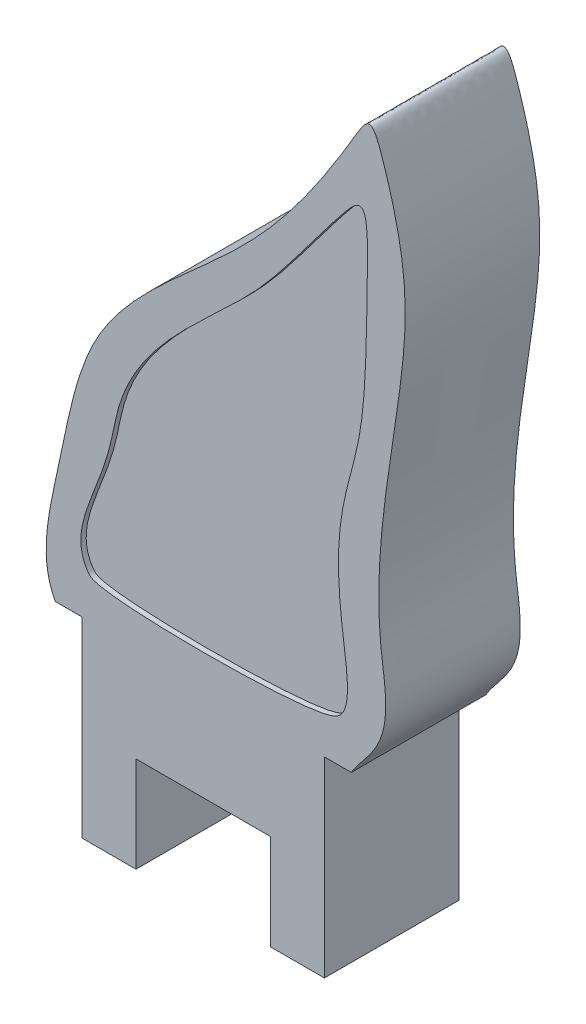
ISO-10303-21;
HEADER;
FILE_DESCRIPTION(('STEP AP214'),'2;1');
FILE_NAME('part.step','',(''),(''),'','','');
FILE_SCHEMA(('AUTOMOTIVE_DESIGN { 1 0 10303 214 1 1 1 1 }'));
ENDSEC;
DATA;
#1=APPLICATION_CONTEXT('core data for automotive mechanical design processes');
#2=APPLICATION_PROTOCOL_DEFINITION('international standard','automotive_design',2000,#1);
#3=PRODUCT_CONTEXT('',#1,'mechanical');
#4=PRODUCT('Part','Part','',(#3));
#5=PRODUCT_RELATED_PRODUCT_CATEGORY('part','',(#4));
#6=PRODUCT_DEFINITION_FORMATION('','',#4);
#7=PRODUCT_DEFINITION_CONTEXT('part definition',#1,'design');
#8=PRODUCT_DEFINITION('design','',#6,#7);
#9=PRODUCT_DEFINITION_SHAPE('','',#8);
#10=(LENGTH_UNIT() NAMED_UNIT(*) SI_UNIT(.MILLI.,.METRE.));
#11=(NAMED_UNIT(*) PLANE_ANGLE_UNIT() SI_UNIT($,.RADIAN.));
#12=(NAMED_UNIT(*) SI_UNIT($,.STERADIAN.) SOLID_ANGLE_UNIT());
#13=UNCERTAINTY_MEASURE_WITH_UNIT(LENGTH_MEASURE(1.E-05),#10,'distance_accuracy_value','');
#14=(GEOMETRIC_REPRESENTATION_CONTEXT(3) GLOBAL_UNCERTAINTY_ASSIGNED_CONTEXT((#13)) GLOBAL_UNIT_ASSIGNED_CONTEXT((#10,
#11,#12)) REPRESENTATION_CONTEXT('',''));
#15=CARTESIAN_POINT('',(0.,0.,0.));
#16=DIRECTION('',(0.,0.,1.));
#17=DIRECTION('',(1.,0.,0.));
#18=AXIS2_PLACEMENT_3D('',#15,#16,#17);
#19=CARTESIAN_POINT('',(-7.35299195823062,-9.52823658467012,13.5506965832842));
#20=DIRECTION('',(0.,1.,0.));
#21=DIRECTION('',(0.,0.,1.));
#22=AXIS2_PLACEMENT_3D('',#19,#20,#21);
#23=PLANE('',#22);
#24=DIRECTION('',(1.,0.,0.));
#25=VECTOR('',#24,1.);
#26=CARTESIAN_POINT('',(-7.35299195823062,-9.52823658467012,13.5506965832842));
#27=LINE('',#26,#25);
#28=CARTESIAN_POINT('',(-7.55299195823062,-9.52823658467012,13.5506965832842));
#29=VERTEX_POINT('',#28);
#30=CARTESIAN_POINT('',(-6.55299195823062,-9.52823658467012,13.5506965832842));
#31=VERTEX_POINT('',#30);
#32=EDGE_CURVE('E158',#29,#31,#27,.T.);
#33=ORIENTED_EDGE('',*,*,#32,.F.);
#34=DIRECTION('',(0.,0.,1.));
#35=VECTOR('',#34,1.);
#36=CARTESIAN_POINT('',(-7.55299195823062,-9.52823658467012,11.0506965832842));
#37=LINE('',#36,#35);
#38=CARTESIAN_POINT('',(-7.55299195823062,-9.52823658467012,11.0506965832842));
#39=VERTEX_POINT('',#38);
#40=EDGE_CURVE('E133',#39,#29,#37,.T.);
#41=ORIENTED_EDGE('',*,*,#40,.F.);
#42=DIRECTION('',(1.,0.,0.));
#43=VECTOR('',#42,1.);
#44=CARTESIAN_POINT('',(-7.35299195823062,-9.52823658467012,11.0506965832842));
#45=LINE('',#44,#43);
#46=CARTESIAN_POINT('',(-6.55299195823062,-9.52823658467012,11.0506965832842));
#47=VERTEX_POINT('',#46);
#48=EDGE_CURVE('E170',#39,#47,#45,.T.);
#49=ORIENTED_EDGE('',*,*,#48,.T.);
#50=DIRECTION('',(0.,0.,-1.));
#51=VECTOR('',#50,1.);
#52=CARTESIAN_POINT('',(-6.55299195823062,-9.52823658467012,13.5506965832842));
#53=LINE('',#52,#51);
#54=EDGE_CURVE('E187',#31,#47,#53,.T.);
#55=ORIENTED_EDGE('',*,*,#54,.F.);
#56=EDGE_LOOP('',(#33,#41,#49,#55));
#57=FACE_BOUND('',#56,.T.);
#58=ADVANCED_FACE('F43',(#57),#23,.F.);
#59=CARTESIAN_POINT('',(-7.35299195823062,-5.97122894272835,13.5506965832842));
#60=DIRECTION('',(0.,1.,0.));
#61=DIRECTION('',(0.,0.,1.));
#62=AXIS2_PLACEMENT_3D('',#59,#60,#61);
#63=PLANE('',#62);
#64=DIRECTION('',(0.,0.,-1.));
#65=VECTOR('',#64,1.);
#66=CARTESIAN_POINT('',(-6.55299195823062,-5.97122894272835,13.5506965832842));
#67=LINE('',#66,#65);
#68=CARTESIAN_POINT('',(-6.55299195823062,-5.97122894272835,13.5506965832842));
#69=VERTEX_POINT('',#68);
#70=CARTESIAN_POINT('',(-6.55299195823062,-5.97122894272835,11.0506965832842));
#71=VERTEX_POINT('',#70);
#72=EDGE_CURVE('E184',#69,#71,#67,.T.);
#73=ORIENTED_EDGE('',*,*,#72,.T.);
#74=DIRECTION('',(1.,0.,0.));
#75=VECTOR('',#74,1.);
#76=CARTESIAN_POINT('',(-7.35299195823062,-5.97122894272835,11.0506965832842));
#77=LINE('',#76,#75);
#78=CARTESIAN_POINT('',(-6.05299195823062,-5.97122894272835,11.0506965832842));
#79=VERTEX_POINT('',#78);
#80=EDGE_CURVE('E229',#71,#79,#77,.T.);
#81=ORIENTED_EDGE('',*,*,#80,.T.);
#82=DIRECTION('',(0.,0.,-1.));
#83=VECTOR('',#82,1.);
#84=CARTESIAN_POINT('',(-6.05299195823062,-5.97122894272835,13.5506965832842));
#85=LINE('',#84,#83);
#86=CARTESIAN_POINT('',(-6.05299195823062,-5.97122894272835,13.5506965832842));
#87=VERTEX_POINT('',#86);
#88=EDGE_CURVE('E53',#87,#79,#85,.T.);
#89=ORIENTED_EDGE('',*,*,#88,.F.);
#90=DIRECTION('',(1.,0.,0.));
#91=VECTOR('',#90,1.);
#92=CARTESIAN_POINT('',(-7.35299195823062,-5.97122894272835,13.5506965832842));
#93=LINE('',#92,#91);
#94=EDGE_CURVE('E68',#69,#87,#93,.T.);
#95=ORIENTED_EDGE('',*,*,#94,.F.);
#96=EDGE_LOOP('',(#73,#81,#89,#95));
#97=FACE_BOUND('',#96,.T.);
#98=ADVANCED_FACE('F218',(#97),#63,.F.);
#99=DIRECTION('',(0.,0.,-1.));
#100=VECTOR('',#99,1.);
#101=CARTESIAN_POINT('',(-11.0529919582306,-5.97122894272835,13.5506965832842));
#102=LINE('',#101,#100);
#103=CARTESIAN_POINT('',(-11.0529919582306,-5.97122894272835,13.5506965832842));
#104=VERTEX_POINT('',#103);
#105=CARTESIAN_POINT('',(-11.0529919582306,-5.97122894272835,11.0506965832842));
#106=VERTEX_POINT('',#105);
#107=EDGE_CURVE('E180',#104,#106,#102,.T.);
#108=ORIENTED_EDGE('',*,*,#107,.F.);
#109=CARTESIAN_POINT('',(-11.5529919582306,-5.97122894272835,13.5506965832842));
#110=VERTEX_POINT('',#109);
#111=EDGE_CURVE('E252',#110,#104,#93,.T.);
#112=ORIENTED_EDGE('',*,*,#111,.F.);
#113=DIRECTION('',(0.,0.,-1.));
#114=VECTOR('',#113,1.);
#115=CARTESIAN_POINT('',(-11.5529919582306,-5.97122894272835,13.5506965832842));
#116=LINE('',#115,#114);
#117=CARTESIAN_POINT('',(-11.5529919582306,-5.97122894272835,11.0506965832842));
#118=VERTEX_POINT('',#117);
#119=EDGE_CURVE('E11',#110,#118,#116,.T.);
#120=ORIENTED_EDGE('',*,*,#119,.T.);
#121=EDGE_CURVE('E242',#118,#106,#77,.T.);
#122=ORIENTED_EDGE('',*,*,#121,.T.);
#123=EDGE_LOOP('',(#108,#112,#120,#122));
#124=FACE_BOUND('',#123,.T.);
#125=ADVANCED_FACE('F220',(#124),#63,.F.);
#126=CARTESIAN_POINT('',(-11.5529919582306,-5.97122894272835,13.5506965832842));
#127=CARTESIAN_POINT('',(-11.872509101007,-5.37784989323544,13.5506965832842));
#128=CARTESIAN_POINT('',(-11.4189386074697,-3.59151995937538,13.5506965832842));
#129=CARTESIAN_POINT('',(-10.9912625424209,-0.946207776332287,13.5506965832842));
#130=CARTESIAN_POINT('',(-8.03450748822834,1.32350664095945,13.5506965832842));
#131=CARTESIAN_POINT('',(-6.7725735437597,2.93701143766177,13.5506965832842));
#132=CARTESIAN_POINT('',(-5.68951168076753,4.8052459651482,13.5506965832842));
#133=CARTESIAN_POINT('',(-5.05268540814889,3.04117219746341,13.5506965832842));
#134=CARTESIAN_POINT('',(-4.93776440878213,0.820328884380788,13.5506965832842));
#135=CARTESIAN_POINT('',(-5.85207429077367,-2.64810633493817,13.5506965832842));
#136=CARTESIAN_POINT('',(-5.23806811581471,-5.06919056456166,13.5506965832842));
#137=CARTESIAN_POINT('',(-5.95779639017991,-5.80356095091459,13.5506965832842));
#138=CARTESIAN_POINT('',(-6.05299195823062,-5.97122894272835,13.5506965832842));
#139=B_SPLINE_CURVE_WITH_KNOTS('',3,(#126,#127,#128,#129,#130,#131,#132,#133,#134,#135,#136,
#137,#138),.UNSPECIFIED.,.F.,.F.,(4,1,1,1,1,1,1,1,1,1,4),(0.,0.0749361636008755,
0.165228530478853,0.281937543117569,0.421795129781682,0.434470620733134,0.452060542403782,
0.554607140477326,0.727323585221969,0.786428047502561,0.806469758436259),.UNSPECIFIED.);
#140=DIRECTION('',(0.,0.,-1.));
#141=VECTOR('',#140,1.);
#142=SURFACE_OF_LINEAR_EXTRUSION('',#139,#141);
#143=CARTESIAN_POINT('',(-11.5529919582306,-5.97122894272835,11.0506965832842));
#144=CARTESIAN_POINT('',(-11.872509101007,-5.37784989323544,11.0506965832842));
#145=CARTESIAN_POINT('',(-11.4189386074697,-3.59151995937538,11.0506965832842));
#146=CARTESIAN_POINT('',(-10.9912625424209,-0.946207776332287,11.0506965832842));
#147=CARTESIAN_POINT('',(-8.03450748822834,1.32350664095945,11.0506965832842));
#148=CARTESIAN_POINT('',(-6.7725735437597,2.93701143766177,11.0506965832842));
#149=CARTESIAN_POINT('',(-5.68951168076753,4.8052459651482,11.0506965832842));
#150=CARTESIAN_POINT('',(-5.05268540814889,3.04117219746341,11.0506965832842));
#151=CARTESIAN_POINT('',(-4.93776440878213,0.820328884380788,11.0506965832842));
#152=CARTESIAN_POINT('',(-5.85207429077367,-2.64810633493817,11.0506965832842));
#153=CARTESIAN_POINT('',(-5.23806811581471,-5.06919056456166,11.0506965832842));
#154=CARTESIAN_POINT('',(-5.95779639017991,-5.80356095091459,11.0506965832842));
#155=CARTESIAN_POINT('',(-6.05299195823062,-5.97122894272835,11.0506965832842));
#156=B_SPLINE_CURVE_WITH_KNOTS('',3,(#143,#144,#145,#146,#147,#148,#149,#150,#151,#152,#153,
#154,#155),.UNSPECIFIED.,.F.,.F.,(4,1,1,1,1,1,1,1,1,1,4),(0.,0.0749361636008755,
0.165228530478853,0.281937543117569,0.421795129781682,0.434470620733134,0.452060542403782,
0.554607140477326,0.727323585221969,0.786428047502561,0.806469758436259),.UNSPECIFIED.);
#157=EDGE_CURVE('E199',#118,#79,#156,.T.);
#158=ORIENTED_EDGE('',*,*,#157,.F.);
#159=ORIENTED_EDGE('',*,*,#119,.F.);
#160=EDGE_CURVE('E246',#110,#87,#139,.T.);
#161=ORIENTED_EDGE('',*,*,#160,.T.);
#162=ORIENTED_EDGE('',*,*,#88,.T.);
#163=EDGE_LOOP('',(#158,#159,#161,#162));
#164=FACE_BOUND('',#163,.T.);
#165=ADVANCED_FACE('F45',(#164),#142,.T.);
#166=CARTESIAN_POINT('',(-7.35299195823062,-3.1874838316435,13.5506965832842));
#167=DIRECTION('',(0.,0.,1.));
#168=DIRECTION('',(1.,0.,0.));
#169=AXIS2_PLACEMENT_3D('',#166,#167,#168);
#170=PLANE('',#169);
#171=DIRECTION('',(0.,-1.,0.));
#172=VECTOR('',#171,1.);
#173=CARTESIAN_POINT('',(-7.55299195823062,-7.75323658467012,13.5506965832842));
#174=LINE('',#173,#172);
#175=CARTESIAN_POINT('',(-7.55299195823062,-7.75323658467012,13.5506965832842));
#176=VERTEX_POINT('',#175);
#177=EDGE_CURVE('E271',#176,#29,#174,.T.);
#178=ORIENTED_EDGE('',*,*,#177,.T.);
#179=ORIENTED_EDGE('',*,*,#32,.T.);
#180=DIRECTION('',(0.,1.,0.));
#181=VECTOR('',#180,1.);
#182=CARTESIAN_POINT('',(-6.55299195823062,-3.1874838316435,13.5506965832842));
#183=LINE('',#182,#181);
#184=EDGE_CURVE('E157',#31,#69,#183,.T.);
#185=ORIENTED_EDGE('',*,*,#184,.T.);
#186=ORIENTED_EDGE('',*,*,#94,.T.);
#187=ORIENTED_EDGE('',*,*,#160,.F.);
#188=ORIENTED_EDGE('',*,*,#111,.T.);
#189=DIRECTION('',(0.,-1.,0.));
#190=VECTOR('',#189,1.);
#191=CARTESIAN_POINT('',(-11.0529919582306,-3.1874838316435,13.5506965832842));
#192=LINE('',#191,#190);
#193=CARTESIAN_POINT('',(-11.0529919582306,-9.52823658467012,13.5506965832842));
#194=VERTEX_POINT('',#193);
#195=EDGE_CURVE('E161',#104,#194,#192,.T.);
#196=ORIENTED_EDGE('',*,*,#195,.T.);
#197=CARTESIAN_POINT('',(-10.0529919582306,-9.52823658467012,13.5506965832842));
#198=VERTEX_POINT('',#197);
#199=EDGE_CURVE('E145',#194,#198,#27,.T.);
#200=ORIENTED_EDGE('',*,*,#199,.T.);
#201=DIRECTION('',(0.,-1.,0.));
#202=VECTOR('',#201,1.);
#203=CARTESIAN_POINT('',(-10.0529919582306,-7.75323658467012,13.5506965832842));
#204=LINE('',#203,#202);
#205=CARTESIAN_POINT('',(-10.0529919582306,-7.75323658467012,13.5506965832842));
#206=VERTEX_POINT('',#205);
#207=EDGE_CURVE('E60',#206,#198,#204,.T.);
#208=ORIENTED_EDGE('',*,*,#207,.F.);
#209=DIRECTION('',(-1.,0.,0.));
#210=VECTOR('',#209,1.);
#211=CARTESIAN_POINT('',(-8.80299195823062,-7.75323658467012,13.5506965832842));
#212=LINE('',#211,#210);
#213=EDGE_CURVE('E124',#176,#206,#212,.T.);
#214=ORIENTED_EDGE('',*,*,#213,.F.);
#215=EDGE_LOOP('',(#178,#179,#185,#186,#187,#188,#196,#200,#208,#214));
#216=FACE_BOUND('',#215,.T.);
#217=CARTESIAN_POINT('',(-10.9433403900203,-5.19421147208954,13.5506965832842));
#218=CARTESIAN_POINT('',(-10.9246638163989,-5.22115989117171,13.5506965832842));
#219=CARTESIAN_POINT('',(-10.7369836205843,-5.46003071747674,13.5506965832842));
#220=CARTESIAN_POINT('',(-6.71670135551473,-5.46065707653684,13.5506965832842));
#221=CARTESIAN_POINT('',(-6.00727902123085,-5.01226361383361,13.5506965832842));
#222=CARTESIAN_POINT('',(-6.19888246194024,-4.04113415649782,13.5506965832842));
#223=CARTESIAN_POINT('',(-6.39857567892798,-1.91231233528845,13.5506965832842));
#224=CARTESIAN_POINT('',(-5.78595654497622,-0.804352241865307,13.5506965832842));
#225=CARTESIAN_POINT('',(-5.77374749565915,1.22327984363832,13.5506965832842));
#226=CARTESIAN_POINT('',(-5.74485890073594,2.64192205723005,13.5506965832842));
#227=CARTESIAN_POINT('',(-5.75371642341469,3.50029254431402,13.5506965832842));
#228=CARTESIAN_POINT('',(-6.84572956904049,2.15872054643966,13.5506965832842));
#229=CARTESIAN_POINT('',(-7.91184113302221,0.509340642368136,13.5506965832842));
#230=CARTESIAN_POINT('',(-10.2366616785652,-1.12787737059055,13.5506965832842));
#231=CARTESIAN_POINT('',(-10.6258183445013,-3.693750308366,13.5506965832842));
#232=CARTESIAN_POINT('',(-11.3319404537248,-4.6335006273515,13.5506965832842));
#233=CARTESIAN_POINT('',(-10.9433403900203,-5.19421147208954,13.5506965832842));
#234=B_SPLINE_CURVE_WITH_KNOTS('',3,(#217,#218,#219,#220,#221,#222,#223,#224,#225,#226,#227,
#228,#229,#230,#231,#232,#233),.UNSPECIFIED.,.T.,.F.,(4,1,1,1,1,1,1,1,1,1,1,1,1,1,4),(0.,
0.00719457443202198,0.0647511698881983,0.0774379970756104,0.121376019118732,0.138945306145948,
0.247638614592384,0.345159243137374,0.361830102418278,0.414347207401426,0.440003173782858,
0.588193752268276,0.809123176165587,0.85030380093876,1.),.UNSPECIFIED.);
#235=CARTESIAN_POINT('',(-10.9433403900203,-5.19421147208954,13.5506965832842));
#236=VERTEX_POINT('',#235);
#237=EDGE_CURVE('E191',#236,#236,#234,.T.);
#238=ORIENTED_EDGE('',*,*,#237,.F.);
#239=EDGE_LOOP('',(#238));
#240=FACE_BOUND('',#239,.T.);
#241=ADVANCED_FACE('F142',(#216,#240),#170,.T.);
#242=CARTESIAN_POINT('',(-7.35299195823062,-3.1874838316435,11.0506965832842));
#243=DIRECTION('',(0.,0.,1.));
#244=DIRECTION('',(1.,0.,0.));
#245=AXIS2_PLACEMENT_3D('',#242,#243,#244);
#246=PLANE('',#245);
#247=ORIENTED_EDGE('',*,*,#48,.F.);
#248=DIRECTION('',(0.,-1.,0.));
#249=VECTOR('',#248,1.);
#250=CARTESIAN_POINT('',(-7.55299195823062,-7.75323658467012,11.0506965832842));
#251=LINE('',#250,#249);
#252=CARTESIAN_POINT('',(-7.55299195823062,-7.75323658467012,11.0506965832842));
#253=VERTEX_POINT('',#252);
#254=EDGE_CURVE('E150',#253,#39,#251,.T.);
#255=ORIENTED_EDGE('',*,*,#254,.F.);
#256=DIRECTION('',(1.,0.,0.));
#257=VECTOR('',#256,1.);
#258=CARTESIAN_POINT('',(-10.0529919582306,-7.75323658467012,11.0506965832842));
#259=LINE('',#258,#257);
#260=CARTESIAN_POINT('',(-10.0529919582306,-7.75323658467012,11.0506965832842));
#261=VERTEX_POINT('',#260);
#262=EDGE_CURVE('E139',#261,#253,#259,.T.);
#263=ORIENTED_EDGE('',*,*,#262,.F.);
#264=DIRECTION('',(0.,-1.,0.));
#265=VECTOR('',#264,1.);
#266=CARTESIAN_POINT('',(-10.0529919582306,-7.75323658467012,11.0506965832842));
#267=LINE('',#266,#265);
#268=CARTESIAN_POINT('',(-10.0529919582306,-9.52823658467012,11.0506965832842));
#269=VERTEX_POINT('',#268);
#270=EDGE_CURVE('E137',#261,#269,#267,.T.);
#271=ORIENTED_EDGE('',*,*,#270,.T.);
#272=CARTESIAN_POINT('',(-11.0529919582306,-9.52823658467012,11.0506965832842));
#273=VERTEX_POINT('',#272);
#274=EDGE_CURVE('E165',#273,#269,#45,.T.);
#275=ORIENTED_EDGE('',*,*,#274,.F.);
#276=DIRECTION('',(0.,-1.,0.));
#277=VECTOR('',#276,1.);
#278=CARTESIAN_POINT('',(-11.0529919582306,-3.1874838316435,11.0506965832842));
#279=LINE('',#278,#277);
#280=EDGE_CURVE('E174',#106,#273,#279,.T.);
#281=ORIENTED_EDGE('',*,*,#280,.F.);
#282=ORIENTED_EDGE('',*,*,#121,.F.);
#283=ORIENTED_EDGE('',*,*,#157,.T.);
#284=ORIENTED_EDGE('',*,*,#80,.F.);
#285=DIRECTION('',(0.,1.,0.));
#286=VECTOR('',#285,1.);
#287=CARTESIAN_POINT('',(-6.55299195823062,-3.1874838316435,11.0506965832842));
#288=LINE('',#287,#286);
#289=EDGE_CURVE('E169',#47,#71,#288,.T.);
#290=ORIENTED_EDGE('',*,*,#289,.F.);
#291=EDGE_LOOP('',(#247,#255,#263,#271,#275,#281,#282,#283,#284,#290));
#292=FACE_BOUND('',#291,.T.);
#293=ADVANCED_FACE('F211',(#292),#246,.F.);
#294=CARTESIAN_POINT('',(-10.9433403900203,-5.19421147208954,13.4506965832842));
#295=CARTESIAN_POINT('',(-10.9246638163989,-5.22115989117171,13.4506965832842));
#296=CARTESIAN_POINT('',(-10.7369836205843,-5.46003071747674,13.4506965832842));
#297=CARTESIAN_POINT('',(-6.71670135551473,-5.46065707653684,13.4506965832842));
#298=CARTESIAN_POINT('',(-6.00727902123085,-5.01226361383361,13.4506965832842));
#299=CARTESIAN_POINT('',(-6.19888246194024,-4.04113415649782,13.4506965832842));
#300=CARTESIAN_POINT('',(-6.39857567892798,-1.91231233528845,13.4506965832842));
#301=CARTESIAN_POINT('',(-5.78595654497622,-0.804352241865307,13.4506965832842));
#302=CARTESIAN_POINT('',(-5.77374749565915,1.22327984363832,13.4506965832842));
#303=CARTESIAN_POINT('',(-5.74485890073594,2.64192205723005,13.4506965832842));
#304=CARTESIAN_POINT('',(-5.75371642341469,3.50029254431402,13.4506965832842));
#305=CARTESIAN_POINT('',(-6.84572956904049,2.15872054643966,13.4506965832842));
#306=CARTESIAN_POINT('',(-7.91184113302221,0.509340642368136,13.4506965832842));
#307=CARTESIAN_POINT('',(-10.2366616785652,-1.12787737059055,13.4506965832842));
#308=CARTESIAN_POINT('',(-10.6258183445013,-3.693750308366,13.4506965832842));
#309=CARTESIAN_POINT('',(-11.3319404537248,-4.6335006273515,13.4506965832842));
#310=CARTESIAN_POINT('',(-10.9433403900203,-5.19421147208954,13.4506965832842));
#311=B_SPLINE_CURVE_WITH_KNOTS('',3,(#294,#295,#296,#297,#298,#299,#300,#301,#302,#303,#304,
#305,#306,#307,#308,#309,#310),.UNSPECIFIED.,.T.,.F.,(4,1,1,1,1,1,1,1,1,1,1,1,1,1,4),(0.,
0.00719457443202198,0.0647511698881983,0.0774379970756104,0.121376019118732,0.138945306145948,
0.247638614592384,0.345159243137374,0.361830102418278,0.414347207401426,0.440003173782858,
0.588193752268276,0.809123176165587,0.85030380093876,1.),.UNSPECIFIED.);
#312=DIRECTION('',(0.,0.,1.));
#313=VECTOR('',#312,1.);
#314=SURFACE_OF_LINEAR_EXTRUSION('',#311,#313);
#315=CARTESIAN_POINT('',(-10.9433403900203,-5.19421147208954,13.4506965832842));
#316=VERTEX_POINT('',#315);
#317=EDGE_CURVE('E192',#316,#316,#311,.T.);
#318=ORIENTED_EDGE('',*,*,#317,.F.);
#319=EDGE_LOOP('',(#318));
#320=FACE_BOUND('',#319,.T.);
#321=ORIENTED_EDGE('',*,*,#237,.T.);
#322=EDGE_LOOP('',(#321));
#323=FACE_BOUND('',#322,.T.);
#324=ADVANCED_FACE('F206',(#320,#323),#314,.F.);
#325=CARTESIAN_POINT('',(-6.9560547419962,1.96597092627953,13.4506965832842));
#326=DIRECTION('',(0.,0.,1.));
#327=DIRECTION('',(1.,0.,0.));
#328=AXIS2_PLACEMENT_3D('',#325,#326,#327);
#329=PLANE('',#328);
#330=ORIENTED_EDGE('',*,*,#317,.T.);
#331=EDGE_LOOP('',(#330));
#332=FACE_BOUND('',#331,.T.);
#333=ADVANCED_FACE('F210',(#332),#329,.T.);
#334=ORIENTED_EDGE('',*,*,#274,.T.);
#335=DIRECTION('',(0.,0.,-1.));
#336=VECTOR('',#335,1.);
#337=CARTESIAN_POINT('',(-10.0529919582306,-9.52823658467012,13.5506965832842));
#338=LINE('',#337,#336);
#339=EDGE_CURVE('E278',#198,#269,#338,.T.);
#340=ORIENTED_EDGE('',*,*,#339,.F.);
#341=ORIENTED_EDGE('',*,*,#199,.F.);
#342=DIRECTION('',(0.,0.,-1.));
#343=VECTOR('',#342,1.);
#344=CARTESIAN_POINT('',(-11.0529919582306,-9.52823658467012,13.5506965832842));
#345=LINE('',#344,#343);
#346=EDGE_CURVE('E164',#194,#273,#345,.T.);
#347=ORIENTED_EDGE('',*,*,#346,.T.);
#348=EDGE_LOOP('',(#334,#340,#341,#347));
#349=FACE_BOUND('',#348,.T.);
#350=ADVANCED_FACE('F227',(#349),#23,.F.);
#351=CARTESIAN_POINT('',(-6.55299195823062,-3.1874838316435,13.5506965832842));
#352=DIRECTION('',(-1.,0.,0.));
#353=DIRECTION('',(0.,0.,1.));
#354=AXIS2_PLACEMENT_3D('',#351,#352,#353);
#355=PLANE('',#354);
#356=ORIENTED_EDGE('',*,*,#289,.T.);
#357=ORIENTED_EDGE('',*,*,#72,.F.);
#358=ORIENTED_EDGE('',*,*,#184,.F.);
#359=ORIENTED_EDGE('',*,*,#54,.T.);
#360=EDGE_LOOP('',(#356,#357,#358,#359));
#361=FACE_BOUND('',#360,.T.);
#362=ADVANCED_FACE('F234',(#361),#355,.F.);
#363=CARTESIAN_POINT('',(-11.0529919582306,-3.1874838316435,13.5506965832842));
#364=DIRECTION('',(1.,0.,0.));
#365=DIRECTION('',(0.,0.,-1.));
#366=AXIS2_PLACEMENT_3D('',#363,#364,#365);
#367=PLANE('',#366);
#368=ORIENTED_EDGE('',*,*,#280,.T.);
#369=ORIENTED_EDGE('',*,*,#346,.F.);
#370=ORIENTED_EDGE('',*,*,#195,.F.);
#371=ORIENTED_EDGE('',*,*,#107,.T.);
#372=EDGE_LOOP('',(#368,#369,#370,#371));
#373=FACE_BOUND('',#372,.T.);
#374=ADVANCED_FACE('F285',(#373),#367,.F.);
#375=CARTESIAN_POINT('',(-7.55299195823062,-7.75323658467012,11.0506965832842));
#376=DIRECTION('',(1.,0.,0.));
#377=DIRECTION('',(0.,0.,-1.));
#378=AXIS2_PLACEMENT_3D('',#375,#376,#377);
#379=PLANE('',#378);
#380=ORIENTED_EDGE('',*,*,#40,.T.);
#381=ORIENTED_EDGE('',*,*,#177,.F.);
#382=DIRECTION('',(0.,0.,1.));
#383=VECTOR('',#382,1.);
#384=CARTESIAN_POINT('',(-7.55299195823062,-7.75323658467012,11.0506965832842));
#385=LINE('',#384,#383);
#386=EDGE_CURVE('E129',#253,#176,#385,.T.);
#387=ORIENTED_EDGE('',*,*,#386,.F.);
#388=ORIENTED_EDGE('',*,*,#254,.T.);
#389=EDGE_LOOP('',(#380,#381,#387,#388));
#390=FACE_BOUND('',#389,.T.);
#391=ADVANCED_FACE('F283',(#390),#379,.F.);
#392=CARTESIAN_POINT('',(-10.0529919582306,-7.75323658467012,13.5506965832842));
#393=DIRECTION('',(-1.,0.,0.));
#394=DIRECTION('',(0.,0.,1.));
#395=AXIS2_PLACEMENT_3D('',#392,#393,#394);
#396=PLANE('',#395);
#397=ORIENTED_EDGE('',*,*,#339,.T.);
#398=ORIENTED_EDGE('',*,*,#270,.F.);
#399=DIRECTION('',(0.,0.,-1.));
#400=VECTOR('',#399,1.);
#401=CARTESIAN_POINT('',(-10.0529919582306,-7.75323658467012,13.5506965832842));
#402=LINE('',#401,#400);
#403=EDGE_CURVE('E126',#206,#261,#402,.T.);
#404=ORIENTED_EDGE('',*,*,#403,.F.);
#405=ORIENTED_EDGE('',*,*,#207,.T.);
#406=EDGE_LOOP('',(#397,#398,#404,#405));
#407=FACE_BOUND('',#406,.T.);
#408=ADVANCED_FACE('F135',(#407),#396,.F.);
#409=CARTESIAN_POINT('',(0.,-7.75323658467012,0.));
#410=DIRECTION('',(0.,-1.,0.));
#411=DIRECTION('',(0.,0.,-1.));
#412=AXIS2_PLACEMENT_3D('',#409,#410,#411);
#413=PLANE('',#412);
#414=ORIENTED_EDGE('',*,*,#213,.T.);
#415=ORIENTED_EDGE('',*,*,#403,.T.);
#416=ORIENTED_EDGE('',*,*,#262,.T.);
#417=ORIENTED_EDGE('',*,*,#386,.T.);
#418=EDGE_LOOP('',(#414,#415,#416,#417));
#419=FACE_BOUND('',#418,.T.);
#420=ADVANCED_FACE('F125',(#419),#413,.T.);
#421=CLOSED_SHELL('',(#58,#98,#125,#165,#241,#293,#324,#333,#350,#362,#374,#391,#408,#420));
#422=MANIFOLD_SOLID_BREP('B2',#421);
#423=ADVANCED_BREP_SHAPE_REPRESENTATION('',(#18,#422),#14);
#424=SHAPE_DEFINITION_REPRESENTATION(#9,#423);
ENDSEC;
END-ISO-10303-21;
